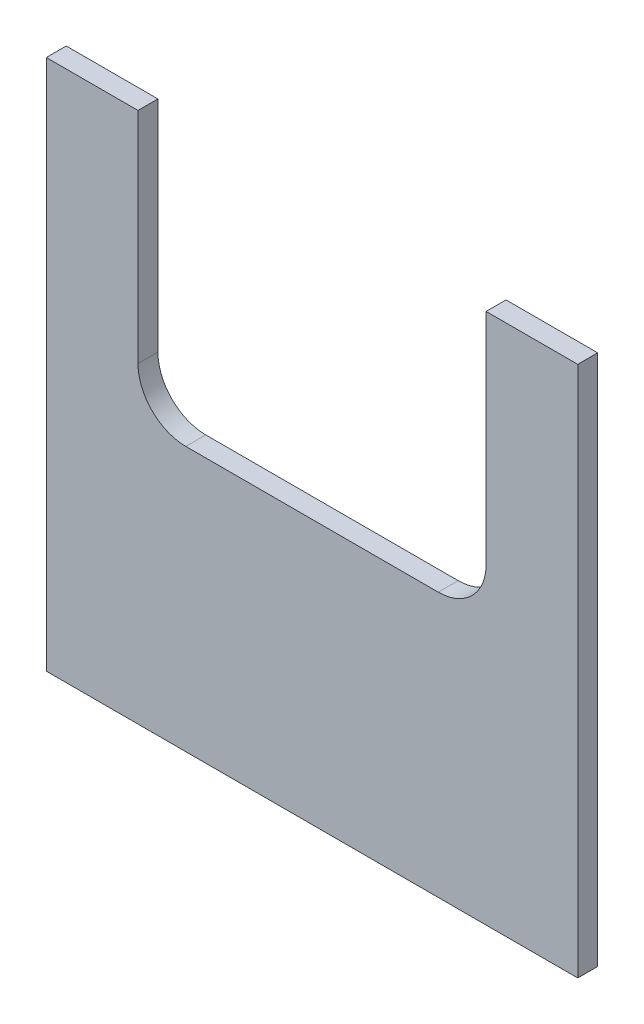
ISO-10303-21;
HEADER;
FILE_DESCRIPTION(('STEP AP214'),'2;1');
FILE_NAME('part.step','',(''),(''),'','','');
FILE_SCHEMA(('AUTOMOTIVE_DESIGN { 1 0 10303 214 1 1 1 1 }'));
ENDSEC;
DATA;
#1=APPLICATION_CONTEXT('core data for automotive mechanical design processes');
#2=APPLICATION_PROTOCOL_DEFINITION('international standard','automotive_design',2000,#1);
#3=PRODUCT_CONTEXT('',#1,'mechanical');
#4=PRODUCT('Part','Part','',(#3));
#5=PRODUCT_RELATED_PRODUCT_CATEGORY('part','',(#4));
#6=PRODUCT_DEFINITION_FORMATION('','',#4);
#7=PRODUCT_DEFINITION_CONTEXT('part definition',#1,'design');
#8=PRODUCT_DEFINITION('design','',#6,#7);
#9=PRODUCT_DEFINITION_SHAPE('','',#8);
#10=(LENGTH_UNIT() NAMED_UNIT(*) SI_UNIT(.MILLI.,.METRE.));
#11=(NAMED_UNIT(*) PLANE_ANGLE_UNIT() SI_UNIT($,.RADIAN.));
#12=(NAMED_UNIT(*) SI_UNIT($,.STERADIAN.) SOLID_ANGLE_UNIT());
#13=UNCERTAINTY_MEASURE_WITH_UNIT(LENGTH_MEASURE(1.E-05),#10,'distance_accuracy_value','');
#14=(GEOMETRIC_REPRESENTATION_CONTEXT(3) GLOBAL_UNCERTAINTY_ASSIGNED_CONTEXT((#13)) GLOBAL_UNIT_ASSIGNED_CONTEXT((#10,
#11,#12)) REPRESENTATION_CONTEXT('',''));
#15=CARTESIAN_POINT('',(0.,0.,0.));
#16=DIRECTION('',(0.,0.,1.));
#17=DIRECTION('',(1.,0.,0.));
#18=AXIS2_PLACEMENT_3D('',#15,#16,#17);
#19=CARTESIAN_POINT('',(-234.910345825204,161.344850299401,-15.));
#20=DIRECTION('',(0.,1.,0.));
#21=DIRECTION('',(-1.,0.,0.));
#22=AXIS2_PLACEMENT_3D('',#19,#20,#21);
#23=PLANE('',#22);
#24=DIRECTION('',(-1.,0.,0.));
#25=VECTOR('',#24,1.);
#26=CARTESIAN_POINT('',(-234.910345825204,161.344850299401,0.));
#27=LINE('',#26,#25);
#28=CARTESIAN_POINT('',(-165.910345825203,161.344850299401,0.));
#29=VERTEX_POINT('',#28);
#30=CARTESIAN_POINT('',(-234.910345825204,161.344850299401,0.));
#31=VERTEX_POINT('',#30);
#32=EDGE_CURVE('E147',#29,#31,#27,.T.);
#33=ORIENTED_EDGE('',*,*,#32,.F.);
#34=DIRECTION('',(0.,0.,1.));
#35=VECTOR('',#34,1.);
#36=CARTESIAN_POINT('',(-165.910345825203,161.344850299401,-15.));
#37=LINE('',#36,#35);
#38=CARTESIAN_POINT('',(-165.910345825203,161.344850299401,-15.));
#39=VERTEX_POINT('',#38);
#40=EDGE_CURVE('E11',#39,#29,#37,.T.);
#41=ORIENTED_EDGE('',*,*,#40,.F.);
#42=DIRECTION('',(-1.,0.,0.));
#43=VECTOR('',#42,1.);
#44=CARTESIAN_POINT('',(-234.910345825204,161.344850299401,-15.));
#45=LINE('',#44,#43);
#46=CARTESIAN_POINT('',(-234.910345825204,161.344850299401,-15.));
#47=VERTEX_POINT('',#46);
#48=EDGE_CURVE('E173',#39,#47,#45,.T.);
#49=ORIENTED_EDGE('',*,*,#48,.T.);
#50=DIRECTION('',(0.,0.,1.));
#51=VECTOR('',#50,1.);
#52=CARTESIAN_POINT('',(-234.910345825204,161.344850299401,-15.));
#53=LINE('',#52,#51);
#54=EDGE_CURVE('E41',#47,#31,#53,.T.);
#55=ORIENTED_EDGE('',*,*,#54,.T.);
#56=EDGE_LOOP('',(#33,#41,#49,#55));
#57=FACE_BOUND('',#56,.T.);
#58=ADVANCED_FACE('F38',(#57),#23,.T.);
#59=CARTESIAN_POINT('',(-165.910345825203,-3.65514970059883,-15.));
#60=DIRECTION('',(1.,0.,0.));
#61=DIRECTION('',(0.,0.,-1.));
#62=AXIS2_PLACEMENT_3D('',#59,#60,#61);
#63=PLANE('',#62);
#64=DIRECTION('',(0.,1.,0.));
#65=VECTOR('',#64,1.);
#66=CARTESIAN_POINT('',(-165.910345825203,-3.65514970059883,0.));
#67=LINE('',#66,#65);
#68=CARTESIAN_POINT('',(-165.910345825203,-3.65514970059882,0.));
#69=VERTEX_POINT('',#68);
#70=EDGE_CURVE('E171',#69,#29,#67,.T.);
#71=ORIENTED_EDGE('',*,*,#70,.F.);
#72=DIRECTION('',(0.,0.,1.));
#73=VECTOR('',#72,1.);
#74=CARTESIAN_POINT('',(-165.910345825203,-3.65514970059882,-15.));
#75=LINE('',#74,#73);
#76=CARTESIAN_POINT('',(-165.910345825203,-3.65514970059882,-15.));
#77=VERTEX_POINT('',#76);
#78=EDGE_CURVE('E47',#77,#69,#75,.T.);
#79=ORIENTED_EDGE('',*,*,#78,.F.);
#80=DIRECTION('',(0.,1.,0.));
#81=VECTOR('',#80,1.);
#82=CARTESIAN_POINT('',(-165.910345825203,-3.65514970059883,-15.));
#83=LINE('',#82,#81);
#84=EDGE_CURVE('E137',#77,#39,#83,.T.);
#85=ORIENTED_EDGE('',*,*,#84,.T.);
#86=ORIENTED_EDGE('',*,*,#40,.T.);
#87=EDGE_LOOP('',(#71,#79,#85,#86));
#88=FACE_BOUND('',#87,.T.);
#89=ADVANCED_FACE('F189',(#88),#63,.T.);
#90=CARTESIAN_POINT('',(-129.910345825203,-3.65514970059883,-15.));
#91=DIRECTION('',(0.,0.,1.));
#92=DIRECTION('',(1.,0.,0.));
#93=AXIS2_PLACEMENT_3D('',#90,#91,#92);
#94=CYLINDRICAL_SURFACE('',#93,36.);
#95=CARTESIAN_POINT('',(-129.910345825203,-3.65514970059883,0.));
#96=DIRECTION('',(0.,0.,-1.));
#97=DIRECTION('',(1.,0.,0.));
#98=AXIS2_PLACEMENT_3D('',#95,#96,#97);
#99=CIRCLE('',#98,36.);
#100=CARTESIAN_POINT('',(-129.910345825203,-39.6551497005988,0.));
#101=VERTEX_POINT('',#100);
#102=EDGE_CURVE('E124',#101,#69,#99,.T.);
#103=ORIENTED_EDGE('',*,*,#102,.F.);
#104=DIRECTION('',(0.,0.,1.));
#105=VECTOR('',#104,1.);
#106=CARTESIAN_POINT('',(-129.910345825203,-39.6551497005988,-15.));
#107=LINE('',#106,#105);
#108=CARTESIAN_POINT('',(-129.910345825203,-39.6551497005988,-15.));
#109=VERTEX_POINT('',#108);
#110=EDGE_CURVE('E119',#109,#101,#107,.T.);
#111=ORIENTED_EDGE('',*,*,#110,.F.);
#112=CARTESIAN_POINT('',(-129.910345825203,-3.65514970059883,-15.));
#113=DIRECTION('',(0.,0.,-1.));
#114=DIRECTION('',(1.,0.,0.));
#115=AXIS2_PLACEMENT_3D('',#112,#113,#114);
#116=CIRCLE('',#115,36.);
#117=EDGE_CURVE('E122',#109,#77,#116,.T.);
#118=ORIENTED_EDGE('',*,*,#117,.T.);
#119=ORIENTED_EDGE('',*,*,#78,.T.);
#120=EDGE_LOOP('',(#103,#111,#118,#119));
#121=FACE_BOUND('',#120,.T.);
#122=ADVANCED_FACE('F121',(#121),#94,.F.);
#123=CARTESIAN_POINT('',(-129.910345825203,-39.6551497005988,-15.));
#124=DIRECTION('',(0.,1.,0.));
#125=DIRECTION('',(0.,0.,1.));
#126=AXIS2_PLACEMENT_3D('',#123,#124,#125);
#127=PLANE('',#126);
#128=DIRECTION('',(-1.,0.,0.));
#129=VECTOR('',#128,1.);
#130=CARTESIAN_POINT('',(-129.910345825203,-39.6551497005988,0.));
#131=LINE('',#130,#129);
#132=CARTESIAN_POINT('',(60.0896541747963,-39.6551497005988,0.));
#133=VERTEX_POINT('',#132);
#134=EDGE_CURVE('E168',#133,#101,#131,.T.);
#135=ORIENTED_EDGE('',*,*,#134,.F.);
#136=DIRECTION('',(0.,0.,1.));
#137=VECTOR('',#136,1.);
#138=CARTESIAN_POINT('',(60.0896541747963,-39.6551497005988,-15.));
#139=LINE('',#138,#137);
#140=CARTESIAN_POINT('',(60.0896541747963,-39.6551497005988,-15.));
#141=VERTEX_POINT('',#140);
#142=EDGE_CURVE('E129',#141,#133,#139,.T.);
#143=ORIENTED_EDGE('',*,*,#142,.F.);
#144=DIRECTION('',(-1.,0.,0.));
#145=VECTOR('',#144,1.);
#146=CARTESIAN_POINT('',(-129.910345825203,-39.6551497005988,-15.));
#147=LINE('',#146,#145);
#148=EDGE_CURVE('E135',#141,#109,#147,.T.);
#149=ORIENTED_EDGE('',*,*,#148,.T.);
#150=ORIENTED_EDGE('',*,*,#110,.T.);
#151=EDGE_LOOP('',(#135,#143,#149,#150));
#152=FACE_BOUND('',#151,.T.);
#153=ADVANCED_FACE('F139',(#152),#127,.T.);
#154=CARTESIAN_POINT('',(60.0896541747965,-3.65514970059883,-15.));
#155=DIRECTION('',(0.,0.,1.));
#156=DIRECTION('',(1.,0.,0.));
#157=AXIS2_PLACEMENT_3D('',#154,#155,#156);
#158=CYLINDRICAL_SURFACE('',#157,36.);
#159=CARTESIAN_POINT('',(60.0896541747965,-3.65514970059883,0.));
#160=DIRECTION('',(0.,0.,-1.));
#161=DIRECTION('',(1.,0.,0.));
#162=AXIS2_PLACEMENT_3D('',#159,#160,#161);
#163=CIRCLE('',#162,36.);
#164=CARTESIAN_POINT('',(96.0896541747965,-3.65514970059883,0.));
#165=VERTEX_POINT('',#164);
#166=EDGE_CURVE('E165',#165,#133,#163,.T.);
#167=ORIENTED_EDGE('',*,*,#166,.F.);
#168=DIRECTION('',(0.,0.,1.));
#169=VECTOR('',#168,1.);
#170=CARTESIAN_POINT('',(96.0896541747965,-3.65514970059883,-15.));
#171=LINE('',#170,#169);
#172=CARTESIAN_POINT('',(96.0896541747965,-3.65514970059883,-15.));
#173=VERTEX_POINT('',#172);
#174=EDGE_CURVE('E177',#173,#165,#171,.T.);
#175=ORIENTED_EDGE('',*,*,#174,.F.);
#176=CARTESIAN_POINT('',(60.0896541747965,-3.65514970059883,-15.));
#177=DIRECTION('',(0.,0.,-1.));
#178=DIRECTION('',(1.,0.,0.));
#179=AXIS2_PLACEMENT_3D('',#176,#177,#178);
#180=CIRCLE('',#179,36.);
#181=EDGE_CURVE('E140',#173,#141,#180,.T.);
#182=ORIENTED_EDGE('',*,*,#181,.T.);
#183=ORIENTED_EDGE('',*,*,#142,.T.);
#184=EDGE_LOOP('',(#167,#175,#182,#183));
#185=FACE_BOUND('',#184,.T.);
#186=ADVANCED_FACE('F202',(#185),#158,.F.);
#187=CARTESIAN_POINT('',(96.0896541747965,161.344850299401,-15.));
#188=DIRECTION('',(-1.,0.,0.));
#189=DIRECTION('',(0.,0.,1.));
#190=AXIS2_PLACEMENT_3D('',#187,#188,#189);
#191=PLANE('',#190);
#192=DIRECTION('',(0.,-1.,0.));
#193=VECTOR('',#192,1.);
#194=CARTESIAN_POINT('',(96.0896541747965,161.344850299401,0.));
#195=LINE('',#194,#193);
#196=CARTESIAN_POINT('',(96.0896541747965,161.344850299401,0.));
#197=VERTEX_POINT('',#196);
#198=EDGE_CURVE('E162',#197,#165,#195,.T.);
#199=ORIENTED_EDGE('',*,*,#198,.F.);
#200=DIRECTION('',(0.,0.,1.));
#201=VECTOR('',#200,1.);
#202=CARTESIAN_POINT('',(96.0896541747965,161.344850299401,-15.));
#203=LINE('',#202,#201);
#204=CARTESIAN_POINT('',(96.0896541747965,161.344850299401,-15.));
#205=VERTEX_POINT('',#204);
#206=EDGE_CURVE('E179',#205,#197,#203,.T.);
#207=ORIENTED_EDGE('',*,*,#206,.F.);
#208=DIRECTION('',(0.,-1.,0.));
#209=VECTOR('',#208,1.);
#210=CARTESIAN_POINT('',(96.0896541747965,161.344850299401,-15.));
#211=LINE('',#210,#209);
#212=EDGE_CURVE('E142',#205,#173,#211,.T.);
#213=ORIENTED_EDGE('',*,*,#212,.T.);
#214=ORIENTED_EDGE('',*,*,#174,.T.);
#215=EDGE_LOOP('',(#199,#207,#213,#214));
#216=FACE_BOUND('',#215,.T.);
#217=ADVANCED_FACE('F205',(#216),#191,.T.);
#218=CARTESIAN_POINT('',(96.0896541747965,161.344850299401,-15.));
#219=DIRECTION('',(0.,1.,0.));
#220=DIRECTION('',(-1.,0.,0.));
#221=AXIS2_PLACEMENT_3D('',#218,#219,#220);
#222=PLANE('',#221);
#223=DIRECTION('',(-1.,0.,0.));
#224=VECTOR('',#223,1.);
#225=CARTESIAN_POINT('',(96.0896541747965,161.344850299401,0.));
#226=LINE('',#225,#224);
#227=CARTESIAN_POINT('',(165.089654174796,161.344850299401,0.));
#228=VERTEX_POINT('',#227);
#229=EDGE_CURVE('E159',#228,#197,#226,.T.);
#230=ORIENTED_EDGE('',*,*,#229,.F.);
#231=DIRECTION('',(0.,0.,1.));
#232=VECTOR('',#231,1.);
#233=CARTESIAN_POINT('',(165.089654174796,161.344850299401,-15.));
#234=LINE('',#233,#232);
#235=CARTESIAN_POINT('',(165.089654174796,161.344850299401,-15.));
#236=VERTEX_POINT('',#235);
#237=EDGE_CURVE('E181',#236,#228,#234,.T.);
#238=ORIENTED_EDGE('',*,*,#237,.F.);
#239=DIRECTION('',(-1.,0.,0.));
#240=VECTOR('',#239,1.);
#241=CARTESIAN_POINT('',(96.0896541747965,161.344850299401,-15.));
#242=LINE('',#241,#240);
#243=EDGE_CURVE('E328',#236,#205,#242,.T.);
#244=ORIENTED_EDGE('',*,*,#243,.T.);
#245=ORIENTED_EDGE('',*,*,#206,.T.);
#246=EDGE_LOOP('',(#230,#238,#244,#245));
#247=FACE_BOUND('',#246,.T.);
#248=ADVANCED_FACE('F209',(#247),#222,.T.);
#249=CARTESIAN_POINT('',(165.089654174796,-238.655149700599,-15.));
#250=DIRECTION('',(1.,0.,0.));
#251=DIRECTION('',(0.,0.,-1.));
#252=AXIS2_PLACEMENT_3D('',#249,#250,#251);
#253=PLANE('',#252);
#254=DIRECTION('',(0.,1.,0.));
#255=VECTOR('',#254,1.);
#256=CARTESIAN_POINT('',(165.089654174796,-238.655149700599,0.));
#257=LINE('',#256,#255);
#258=CARTESIAN_POINT('',(165.089654174796,-238.655149700599,0.));
#259=VERTEX_POINT('',#258);
#260=EDGE_CURVE('E156',#259,#228,#257,.T.);
#261=ORIENTED_EDGE('',*,*,#260,.F.);
#262=DIRECTION('',(0.,0.,1.));
#263=VECTOR('',#262,1.);
#264=CARTESIAN_POINT('',(165.089654174796,-238.655149700599,-15.));
#265=LINE('',#264,#263);
#266=CARTESIAN_POINT('',(165.089654174796,-238.655149700599,-15.));
#267=VERTEX_POINT('',#266);
#268=EDGE_CURVE('E183',#267,#259,#265,.T.);
#269=ORIENTED_EDGE('',*,*,#268,.F.);
#270=DIRECTION('',(0.,1.,0.));
#271=VECTOR('',#270,1.);
#272=CARTESIAN_POINT('',(165.089654174796,-238.655149700599,-15.));
#273=LINE('',#272,#271);
#274=EDGE_CURVE('E324',#267,#236,#273,.T.);
#275=ORIENTED_EDGE('',*,*,#274,.T.);
#276=ORIENTED_EDGE('',*,*,#237,.T.);
#277=EDGE_LOOP('',(#261,#269,#275,#276));
#278=FACE_BOUND('',#277,.T.);
#279=ADVANCED_FACE('F213',(#278),#253,.T.);
#280=CARTESIAN_POINT('',(-234.910345825204,-238.655149700599,-15.));
#281=DIRECTION('',(0.,-1.,0.));
#282=DIRECTION('',(1.,0.,0.));
#283=AXIS2_PLACEMENT_3D('',#280,#281,#282);
#284=PLANE('',#283);
#285=DIRECTION('',(1.,0.,0.));
#286=VECTOR('',#285,1.);
#287=CARTESIAN_POINT('',(-234.910345825204,-238.655149700599,0.));
#288=LINE('',#287,#286);
#289=CARTESIAN_POINT('',(-234.910345825204,-238.655149700599,0.));
#290=VERTEX_POINT('',#289);
#291=EDGE_CURVE('E153',#290,#259,#288,.T.);
#292=ORIENTED_EDGE('',*,*,#291,.F.);
#293=DIRECTION('',(0.,0.,1.));
#294=VECTOR('',#293,1.);
#295=CARTESIAN_POINT('',(-234.910345825204,-238.655149700599,-15.));
#296=LINE('',#295,#294);
#297=CARTESIAN_POINT('',(-234.910345825204,-238.655149700599,-15.));
#298=VERTEX_POINT('',#297);
#299=EDGE_CURVE('E184',#298,#290,#296,.T.);
#300=ORIENTED_EDGE('',*,*,#299,.F.);
#301=DIRECTION('',(1.,0.,0.));
#302=VECTOR('',#301,1.);
#303=CARTESIAN_POINT('',(-234.910345825204,-238.655149700599,-15.));
#304=LINE('',#303,#302);
#305=EDGE_CURVE('E335',#298,#267,#304,.T.);
#306=ORIENTED_EDGE('',*,*,#305,.T.);
#307=ORIENTED_EDGE('',*,*,#268,.T.);
#308=EDGE_LOOP('',(#292,#300,#306,#307));
#309=FACE_BOUND('',#308,.T.);
#310=ADVANCED_FACE('F217',(#309),#284,.T.);
#311=CARTESIAN_POINT('',(-234.910345825204,161.344850299401,-15.));
#312=DIRECTION('',(-1.,0.,0.));
#313=DIRECTION('',(0.,-1.,0.));
#314=AXIS2_PLACEMENT_3D('',#311,#312,#313);
#315=PLANE('',#314);
#316=DIRECTION('',(0.,-1.,0.));
#317=VECTOR('',#316,1.);
#318=CARTESIAN_POINT('',(-234.910345825204,161.344850299401,0.));
#319=LINE('',#318,#317);
#320=EDGE_CURVE('E150',#31,#290,#319,.T.);
#321=ORIENTED_EDGE('',*,*,#320,.F.);
#322=ORIENTED_EDGE('',*,*,#54,.F.);
#323=DIRECTION('',(0.,-1.,0.));
#324=VECTOR('',#323,1.);
#325=CARTESIAN_POINT('',(-234.910345825204,161.344850299401,-15.));
#326=LINE('',#325,#324);
#327=EDGE_CURVE('E337',#47,#298,#326,.T.);
#328=ORIENTED_EDGE('',*,*,#327,.T.);
#329=ORIENTED_EDGE('',*,*,#299,.T.);
#330=EDGE_LOOP('',(#321,#322,#328,#329));
#331=FACE_BOUND('',#330,.T.);
#332=ADVANCED_FACE('F186',(#331),#315,.T.);
#333=CARTESIAN_POINT('',(-129.910345825203,-3.65514970059883,-15.));
#334=DIRECTION('',(0.,0.,1.));
#335=DIRECTION('',(1.,0.,0.));
#336=AXIS2_PLACEMENT_3D('',#333,#334,#335);
#337=PLANE('',#336);
#338=ORIENTED_EDGE('',*,*,#48,.F.);
#339=ORIENTED_EDGE('',*,*,#84,.F.);
#340=ORIENTED_EDGE('',*,*,#117,.F.);
#341=ORIENTED_EDGE('',*,*,#148,.F.);
#342=ORIENTED_EDGE('',*,*,#181,.F.);
#343=ORIENTED_EDGE('',*,*,#212,.F.);
#344=ORIENTED_EDGE('',*,*,#243,.F.);
#345=ORIENTED_EDGE('',*,*,#274,.F.);
#346=ORIENTED_EDGE('',*,*,#305,.F.);
#347=ORIENTED_EDGE('',*,*,#327,.F.);
#348=EDGE_LOOP('',(#338,#339,#340,#341,#342,#343,#344,#345,#346,#347));
#349=FACE_BOUND('',#348,.T.);
#350=ADVANCED_FACE('F133',(#349),#337,.F.);
#351=CARTESIAN_POINT('',(-129.910345825203,-3.65514970059883,0.));
#352=DIRECTION('',(0.,0.,1.));
#353=DIRECTION('',(1.,0.,0.));
#354=AXIS2_PLACEMENT_3D('',#351,#352,#353);
#355=PLANE('',#354);
#356=ORIENTED_EDGE('',*,*,#32,.T.);
#357=ORIENTED_EDGE('',*,*,#320,.T.);
#358=ORIENTED_EDGE('',*,*,#291,.T.);
#359=ORIENTED_EDGE('',*,*,#260,.T.);
#360=ORIENTED_EDGE('',*,*,#229,.T.);
#361=ORIENTED_EDGE('',*,*,#198,.T.);
#362=ORIENTED_EDGE('',*,*,#166,.T.);
#363=ORIENTED_EDGE('',*,*,#134,.T.);
#364=ORIENTED_EDGE('',*,*,#102,.T.);
#365=ORIENTED_EDGE('',*,*,#70,.T.);
#366=EDGE_LOOP('',(#356,#357,#358,#359,#360,#361,#362,#363,#364,#365));
#367=FACE_BOUND('',#366,.T.);
#368=ADVANCED_FACE('F188',(#367),#355,.T.);
#369=CLOSED_SHELL('',(#58,#89,#122,#153,#186,#217,#248,#279,#310,#332,#350,#368));
#370=MANIFOLD_SOLID_BREP('B2',#369);
#371=ADVANCED_BREP_SHAPE_REPRESENTATION('',(#18,#370),#14);
#372=SHAPE_DEFINITION_REPRESENTATION(#9,#371);
ENDSEC;
END-ISO-10303-21;
